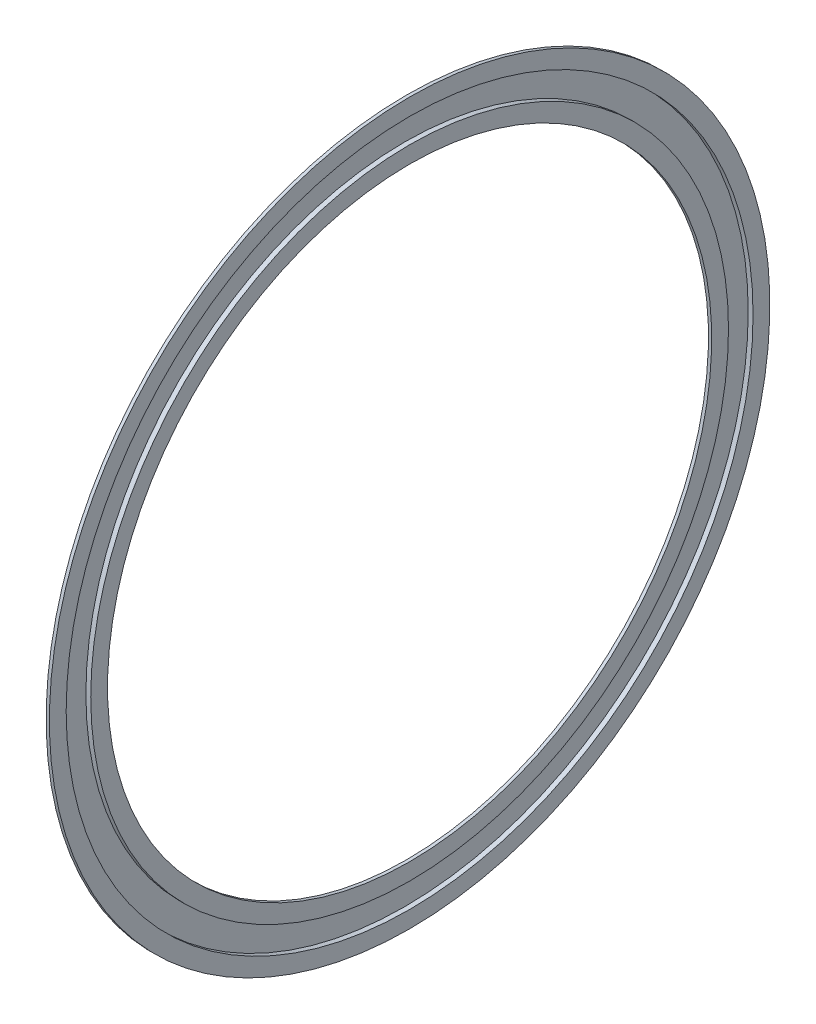
ISO-10303-21;
HEADER;
FILE_DESCRIPTION(('STEP AP214'),'2;1');
FILE_NAME('part.step','',(''),(''),'','','');
FILE_SCHEMA(('AUTOMOTIVE_DESIGN { 1 0 10303 214 1 1 1 1 }'));
ENDSEC;
DATA;
#1=APPLICATION_CONTEXT('core data for automotive mechanical design processes');
#2=APPLICATION_PROTOCOL_DEFINITION('international standard','automotive_design',2000,#1);
#3=PRODUCT_CONTEXT('',#1,'mechanical');
#4=PRODUCT('Part','Part','',(#3));
#5=PRODUCT_RELATED_PRODUCT_CATEGORY('part','',(#4));
#6=PRODUCT_DEFINITION_FORMATION('','',#4);
#7=PRODUCT_DEFINITION_CONTEXT('part definition',#1,'design');
#8=PRODUCT_DEFINITION('design','',#6,#7);
#9=PRODUCT_DEFINITION_SHAPE('','',#8);
#10=(LENGTH_UNIT() NAMED_UNIT(*) SI_UNIT(.MILLI.,.METRE.));
#11=(NAMED_UNIT(*) PLANE_ANGLE_UNIT() SI_UNIT($,.RADIAN.));
#12=(NAMED_UNIT(*) SI_UNIT($,.STERADIAN.) SOLID_ANGLE_UNIT());
#13=UNCERTAINTY_MEASURE_WITH_UNIT(LENGTH_MEASURE(1.E-05),#10,'distance_accuracy_value','');
#14=(GEOMETRIC_REPRESENTATION_CONTEXT(3) GLOBAL_UNCERTAINTY_ASSIGNED_CONTEXT((#13)) GLOBAL_UNIT_ASSIGNED_CONTEXT((#10,
#11,#12)) REPRESENTATION_CONTEXT('',''));
#15=CARTESIAN_POINT('',(0.,0.,0.));
#16=DIRECTION('',(0.,0.,1.));
#17=DIRECTION('',(1.,0.,0.));
#18=AXIS2_PLACEMENT_3D('',#15,#16,#17);
#19=CARTESIAN_POINT('',(-3.,21.78,0.));
#20=DIRECTION('',(1.,0.,0.));
#21=DIRECTION('',(0.,1.,0.));
#22=AXIS2_PLACEMENT_3D('',#19,#20,#21);
#23=PLANE('',#22);
#24=CARTESIAN_POINT('',(-3.,0.,0.));
#25=DIRECTION('',(1.,0.,0.));
#26=DIRECTION('',(0.,1.,0.));
#27=AXIS2_PLACEMENT_3D('',#24,#25,#26);
#28=CIRCLE('',#27,22.3);
#29=CARTESIAN_POINT('',(-3.,22.3,0.));
#30=VERTEX_POINT('',#29);
#31=EDGE_CURVE('E11',#30,#30,#28,.T.);
#32=ORIENTED_EDGE('',*,*,#31,.T.);
#33=EDGE_LOOP('',(#32));
#34=FACE_BOUND('',#33,.T.);
#35=CARTESIAN_POINT('',(-3.,0.,0.));
#36=DIRECTION('',(1.,0.,0.));
#37=DIRECTION('',(0.,1.,0.));
#38=AXIS2_PLACEMENT_3D('',#35,#36,#37);
#39=CIRCLE('',#38,21.26);
#40=CARTESIAN_POINT('',(-3.,21.26,0.));
#41=VERTEX_POINT('',#40);
#42=EDGE_CURVE('E83',#41,#41,#39,.T.);
#43=ORIENTED_EDGE('',*,*,#42,.F.);
#44=EDGE_LOOP('',(#43));
#45=FACE_BOUND('',#44,.T.);
#46=ADVANCED_FACE('F16',(#34,#45),#23,.T.);
#47=CARTESIAN_POINT('',(-3.1,0.,0.));
#48=DIRECTION('',(-1.,0.,0.));
#49=DIRECTION('',(0.,1.,0.));
#50=AXIS2_PLACEMENT_3D('',#47,#48,#49);
#51=CYLINDRICAL_SURFACE('',#50,22.3);
#52=CARTESIAN_POINT('',(-3.2,0.,0.));
#53=DIRECTION('',(1.,0.,0.));
#54=DIRECTION('',(0.,1.,0.));
#55=AXIS2_PLACEMENT_3D('',#52,#53,#54);
#56=CIRCLE('',#55,22.3);
#57=CARTESIAN_POINT('',(-3.2,22.3,0.));
#58=VERTEX_POINT('',#57);
#59=EDGE_CURVE('E26',#58,#58,#56,.T.);
#60=ORIENTED_EDGE('',*,*,#59,.T.);
#61=EDGE_LOOP('',(#60));
#62=FACE_BOUND('',#61,.T.);
#63=ORIENTED_EDGE('',*,*,#31,.F.);
#64=EDGE_LOOP('',(#63));
#65=FACE_BOUND('',#64,.T.);
#66=ADVANCED_FACE('F18',(#62,#65),#51,.T.);
#67=CARTESIAN_POINT('',(-3.2,21.88,0.));
#68=DIRECTION('',(-1.,0.,0.));
#69=DIRECTION('',(0.,-1.,0.));
#70=AXIS2_PLACEMENT_3D('',#67,#68,#69);
#71=PLANE('',#70);
#72=CARTESIAN_POINT('',(-3.2,0.,0.));
#73=DIRECTION('',(1.,0.,0.));
#74=DIRECTION('',(0.,1.,0.));
#75=AXIS2_PLACEMENT_3D('',#72,#73,#74);
#76=CIRCLE('',#75,21.46);
#77=CARTESIAN_POINT('',(-3.2,21.46,0.));
#78=VERTEX_POINT('',#77);
#79=EDGE_CURVE('E74',#78,#78,#76,.T.);
#80=ORIENTED_EDGE('',*,*,#79,.T.);
#81=EDGE_LOOP('',(#80));
#82=FACE_BOUND('',#81,.T.);
#83=ORIENTED_EDGE('',*,*,#59,.F.);
#84=EDGE_LOOP('',(#83));
#85=FACE_BOUND('',#84,.T.);
#86=ADVANCED_FACE('F101',(#82,#85),#71,.T.);
#87=CARTESIAN_POINT('',(-3.35,0.,0.));
#88=DIRECTION('',(-1.,0.,0.));
#89=DIRECTION('',(0.,1.,0.));
#90=AXIS2_PLACEMENT_3D('',#87,#88,#89);
#91=CYLINDRICAL_SURFACE('',#90,21.46);
#92=CARTESIAN_POINT('',(-3.5,0.,0.));
#93=DIRECTION('',(1.,0.,0.));
#94=DIRECTION('',(0.,1.,0.));
#95=AXIS2_PLACEMENT_3D('',#92,#93,#94);
#96=CIRCLE('',#95,21.46);
#97=CARTESIAN_POINT('',(-3.5,21.46,0.));
#98=VERTEX_POINT('',#97);
#99=EDGE_CURVE('E20',#98,#98,#96,.T.);
#100=ORIENTED_EDGE('',*,*,#99,.T.);
#101=EDGE_LOOP('',(#100));
#102=FACE_BOUND('',#101,.T.);
#103=ORIENTED_EDGE('',*,*,#79,.F.);
#104=EDGE_LOOP('',(#103));
#105=FACE_BOUND('',#104,.T.);
#106=ADVANCED_FACE('F71',(#102,#105),#91,.T.);
#107=CARTESIAN_POINT('',(-3.5,20.5,0.));
#108=DIRECTION('',(-1.,0.,0.));
#109=DIRECTION('',(0.,-1.,0.));
#110=AXIS2_PLACEMENT_3D('',#107,#108,#109);
#111=PLANE('',#110);
#112=CARTESIAN_POINT('',(-3.5,0.,0.));
#113=DIRECTION('',(1.,0.,0.));
#114=DIRECTION('',(0.,1.,0.));
#115=AXIS2_PLACEMENT_3D('',#112,#113,#114);
#116=CIRCLE('',#115,19.54);
#117=CARTESIAN_POINT('',(-3.5,19.54,0.));
#118=VERTEX_POINT('',#117);
#119=EDGE_CURVE('E67',#118,#118,#116,.T.);
#120=ORIENTED_EDGE('',*,*,#119,.T.);
#121=EDGE_LOOP('',(#120));
#122=FACE_BOUND('',#121,.T.);
#123=ORIENTED_EDGE('',*,*,#99,.F.);
#124=EDGE_LOOP('',(#123));
#125=FACE_BOUND('',#124,.T.);
#126=ADVANCED_FACE('F105',(#122,#125),#111,.T.);
#127=CARTESIAN_POINT('',(-3.35,0.,0.));
#128=DIRECTION('',(-1.,0.,0.));
#129=DIRECTION('',(0.,1.,0.));
#130=AXIS2_PLACEMENT_3D('',#127,#128,#129);
#131=CYLINDRICAL_SURFACE('',#130,19.54);
#132=CARTESIAN_POINT('',(-3.2,0.,0.));
#133=DIRECTION('',(1.,0.,0.));
#134=DIRECTION('',(0.,1.,0.));
#135=AXIS2_PLACEMENT_3D('',#132,#133,#134);
#136=CIRCLE('',#135,19.54);
#137=CARTESIAN_POINT('',(-3.2,19.54,0.));
#138=VERTEX_POINT('',#137);
#139=EDGE_CURVE('E76',#138,#138,#136,.T.);
#140=ORIENTED_EDGE('',*,*,#139,.T.);
#141=EDGE_LOOP('',(#140));
#142=FACE_BOUND('',#141,.T.);
#143=ORIENTED_EDGE('',*,*,#119,.F.);
#144=EDGE_LOOP('',(#143));
#145=FACE_BOUND('',#144,.T.);
#146=ADVANCED_FACE('F140',(#142,#145),#131,.F.);
#147=CARTESIAN_POINT('',(-3.2,19.12,0.));
#148=DIRECTION('',(-1.,0.,0.));
#149=DIRECTION('',(0.,-1.,0.));
#150=AXIS2_PLACEMENT_3D('',#147,#148,#149);
#151=PLANE('',#150);
#152=CARTESIAN_POINT('',(-3.2,0.,0.));
#153=DIRECTION('',(1.,0.,0.));
#154=DIRECTION('',(0.,1.,0.));
#155=AXIS2_PLACEMENT_3D('',#152,#153,#154);
#156=CIRCLE('',#155,18.7);
#157=CARTESIAN_POINT('',(-3.2,18.7,0.));
#158=VERTEX_POINT('',#157);
#159=EDGE_CURVE('E78',#158,#158,#156,.T.);
#160=ORIENTED_EDGE('',*,*,#159,.T.);
#161=EDGE_LOOP('',(#160));
#162=FACE_BOUND('',#161,.T.);
#163=ORIENTED_EDGE('',*,*,#139,.F.);
#164=EDGE_LOOP('',(#163));
#165=FACE_BOUND('',#164,.T.);
#166=ADVANCED_FACE('F110',(#162,#165),#151,.T.);
#167=CARTESIAN_POINT('',(-3.1,0.,0.));
#168=DIRECTION('',(-1.,0.,0.));
#169=DIRECTION('',(0.,1.,0.));
#170=AXIS2_PLACEMENT_3D('',#167,#168,#169);
#171=CYLINDRICAL_SURFACE('',#170,18.7);
#172=CARTESIAN_POINT('',(-3.,0.,0.));
#173=DIRECTION('',(1.,0.,0.));
#174=DIRECTION('',(0.,1.,0.));
#175=AXIS2_PLACEMENT_3D('',#172,#173,#174);
#176=CIRCLE('',#175,18.7);
#177=CARTESIAN_POINT('',(-3.,18.7,0.));
#178=VERTEX_POINT('',#177);
#179=EDGE_CURVE('E80',#178,#178,#176,.T.);
#180=ORIENTED_EDGE('',*,*,#179,.T.);
#181=EDGE_LOOP('',(#180));
#182=FACE_BOUND('',#181,.T.);
#183=ORIENTED_EDGE('',*,*,#159,.F.);
#184=EDGE_LOOP('',(#183));
#185=FACE_BOUND('',#184,.T.);
#186=ADVANCED_FACE('F107',(#182,#185),#171,.F.);
#187=CARTESIAN_POINT('',(-3.,19.22,0.));
#188=DIRECTION('',(1.,0.,0.));
#189=DIRECTION('',(0.,1.,0.));
#190=AXIS2_PLACEMENT_3D('',#187,#188,#189);
#191=PLANE('',#190);
#192=CARTESIAN_POINT('',(-3.,0.,0.));
#193=DIRECTION('',(1.,0.,0.));
#194=DIRECTION('',(0.,1.,0.));
#195=AXIS2_PLACEMENT_3D('',#192,#193,#194);
#196=CIRCLE('',#195,19.74);
#197=CARTESIAN_POINT('',(-3.,19.74,0.));
#198=VERTEX_POINT('',#197);
#199=EDGE_CURVE('E53',#198,#198,#196,.T.);
#200=ORIENTED_EDGE('',*,*,#199,.T.);
#201=EDGE_LOOP('',(#200));
#202=FACE_BOUND('',#201,.T.);
#203=ORIENTED_EDGE('',*,*,#179,.F.);
#204=EDGE_LOOP('',(#203));
#205=FACE_BOUND('',#204,.T.);
#206=ADVANCED_FACE('F109',(#202,#205),#191,.T.);
#207=CARTESIAN_POINT('',(-3.15,0.,0.));
#208=DIRECTION('',(-1.,0.,0.));
#209=DIRECTION('',(0.,1.,0.));
#210=AXIS2_PLACEMENT_3D('',#207,#208,#209);
#211=CYLINDRICAL_SURFACE('',#210,19.74);
#212=CARTESIAN_POINT('',(-3.3,0.,0.));
#213=DIRECTION('',(1.,0.,0.));
#214=DIRECTION('',(0.,1.,0.));
#215=AXIS2_PLACEMENT_3D('',#212,#213,#214);
#216=CIRCLE('',#215,19.74);
#217=CARTESIAN_POINT('',(-3.3,19.74,0.));
#218=VERTEX_POINT('',#217);
#219=EDGE_CURVE('E59',#218,#218,#216,.T.);
#220=ORIENTED_EDGE('',*,*,#219,.T.);
#221=EDGE_LOOP('',(#220));
#222=FACE_BOUND('',#221,.T.);
#223=ORIENTED_EDGE('',*,*,#199,.F.);
#224=EDGE_LOOP('',(#223));
#225=FACE_BOUND('',#224,.T.);
#226=ADVANCED_FACE('F112',(#222,#225),#211,.T.);
#227=CARTESIAN_POINT('',(-3.3,20.5,0.));
#228=DIRECTION('',(1.,0.,0.));
#229=DIRECTION('',(0.,1.,0.));
#230=AXIS2_PLACEMENT_3D('',#227,#228,#229);
#231=PLANE('',#230);
#232=CARTESIAN_POINT('',(-3.3,0.,0.));
#233=DIRECTION('',(1.,0.,0.));
#234=DIRECTION('',(0.,1.,0.));
#235=AXIS2_PLACEMENT_3D('',#232,#233,#234);
#236=CIRCLE('',#235,21.26);
#237=CARTESIAN_POINT('',(-3.3,21.26,0.));
#238=VERTEX_POINT('',#237);
#239=EDGE_CURVE('E85',#238,#238,#236,.T.);
#240=ORIENTED_EDGE('',*,*,#239,.T.);
#241=EDGE_LOOP('',(#240));
#242=FACE_BOUND('',#241,.T.);
#243=ORIENTED_EDGE('',*,*,#219,.F.);
#244=EDGE_LOOP('',(#243));
#245=FACE_BOUND('',#244,.T.);
#246=ADVANCED_FACE('F114',(#242,#245),#231,.T.);
#247=CARTESIAN_POINT('',(-3.15,0.,0.));
#248=DIRECTION('',(-1.,0.,0.));
#249=DIRECTION('',(0.,1.,0.));
#250=AXIS2_PLACEMENT_3D('',#247,#248,#249);
#251=CYLINDRICAL_SURFACE('',#250,21.26);
#252=ORIENTED_EDGE('',*,*,#42,.T.);
#253=EDGE_LOOP('',(#252));
#254=FACE_BOUND('',#253,.T.);
#255=ORIENTED_EDGE('',*,*,#239,.F.);
#256=EDGE_LOOP('',(#255));
#257=FACE_BOUND('',#256,.T.);
#258=ADVANCED_FACE('F92',(#254,#257),#251,.F.);
#259=CLOSED_SHELL('',(#46,#66,#86,#106,#126,#146,#166,#186,#206,#226,#246,#258));
#260=MANIFOLD_SOLID_BREP('B1',#259);
#261=ADVANCED_BREP_SHAPE_REPRESENTATION('',(#18,#260),#14);
#262=SHAPE_DEFINITION_REPRESENTATION(#9,#261);
ENDSEC;
END-ISO-10303-21;
